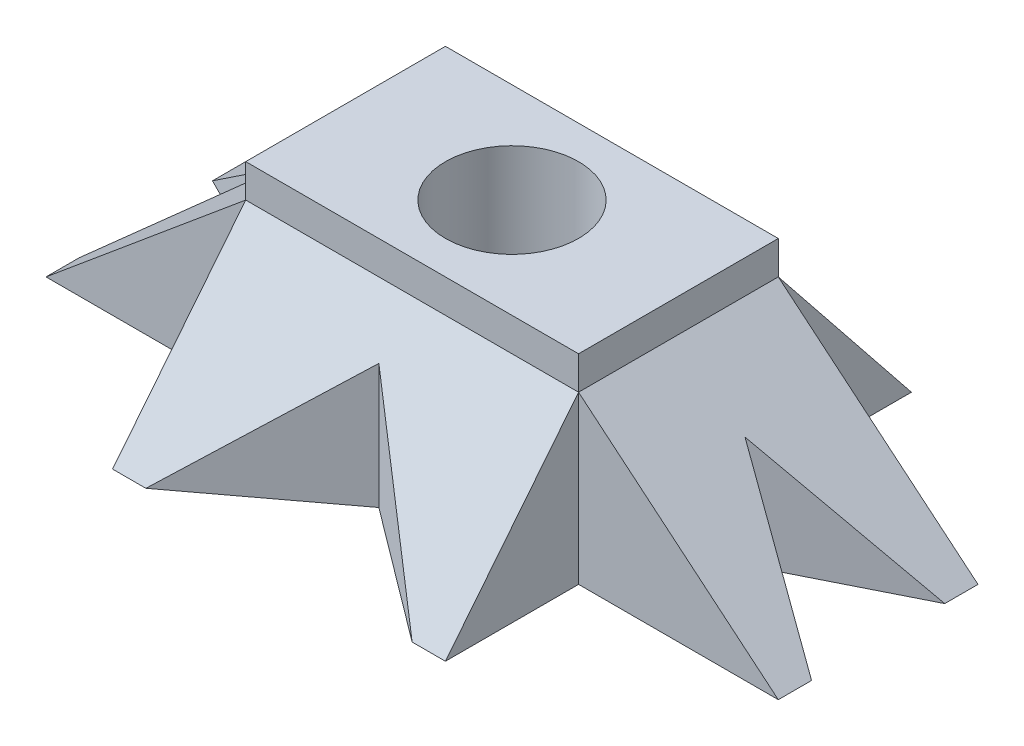
ISO-10303-21;
HEADER;
FILE_DESCRIPTION(('STEP AP214'),'2;1');
FILE_NAME('part.step','',(''),(''),'','','');
FILE_SCHEMA(('AUTOMOTIVE_DESIGN { 1 0 10303 214 1 1 1 1 }'));
ENDSEC;
DATA;
#1=APPLICATION_CONTEXT('core data for automotive mechanical design processes');
#2=APPLICATION_PROTOCOL_DEFINITION('international standard','automotive_design',2000,#1);
#3=PRODUCT_CONTEXT('',#1,'mechanical');
#4=PRODUCT('Part','Part','',(#3));
#5=PRODUCT_RELATED_PRODUCT_CATEGORY('part','',(#4));
#6=PRODUCT_DEFINITION_FORMATION('','',#4);
#7=PRODUCT_DEFINITION_CONTEXT('part definition',#1,'design');
#8=PRODUCT_DEFINITION('design','',#6,#7);
#9=PRODUCT_DEFINITION_SHAPE('','',#8);
#10=(LENGTH_UNIT() NAMED_UNIT(*) SI_UNIT(.MILLI.,.METRE.));
#11=(NAMED_UNIT(*) PLANE_ANGLE_UNIT() SI_UNIT($,.RADIAN.));
#12=(NAMED_UNIT(*) SI_UNIT($,.STERADIAN.) SOLID_ANGLE_UNIT());
#13=UNCERTAINTY_MEASURE_WITH_UNIT(LENGTH_MEASURE(1.E-05),#10,'distance_accuracy_value','');
#14=(GEOMETRIC_REPRESENTATION_CONTEXT(3) GLOBAL_UNCERTAINTY_ASSIGNED_CONTEXT((#13)) GLOBAL_UNIT_ASSIGNED_CONTEXT((#10,
#11,#12)) REPRESENTATION_CONTEXT('',''));
#15=CARTESIAN_POINT('',(0.,0.,0.));
#16=DIRECTION('',(0.,0.,1.));
#17=DIRECTION('',(1.,0.,0.));
#18=AXIS2_PLACEMENT_3D('',#15,#16,#17);
#19=CARTESIAN_POINT('',(0.,0.,0.));
#20=DIRECTION('',(0.,1.,0.));
#21=DIRECTION('',(0.,0.,1.));
#22=AXIS2_PLACEMENT_3D('',#19,#20,#21);
#23=PLANE('',#22);
#24=CARTESIAN_POINT('',(0.,0.,0.));
#25=DIRECTION('',(0.,1.,0.));
#26=DIRECTION('',(0.,0.,1.));
#27=AXIS2_PLACEMENT_3D('',#24,#25,#26);
#28=CIRCLE('',#27,20.);
#29=CARTESIAN_POINT('',(0.,0.,20.));
#30=VERTEX_POINT('',#29);
#31=EDGE_CURVE('E239',#30,#30,#28,.T.);
#32=ORIENTED_EDGE('',*,*,#31,.T.);
#33=EDGE_LOOP('',(#32));
#34=FACE_BOUND('',#33,.T.);
#35=DIRECTION('',(-0.8,0.,-0.6));
#36=VECTOR('',#35,1.);
#37=CARTESIAN_POINT('',(0.,0.,40.));
#38=LINE('',#37,#36);
#39=CARTESIAN_POINT('',(40.,0.,70.));
#40=VERTEX_POINT('',#39);
#41=CARTESIAN_POINT('',(0.,0.,40.));
#42=VERTEX_POINT('',#41);
#43=EDGE_CURVE('E164',#40,#42,#38,.T.);
#44=ORIENTED_EDGE('',*,*,#43,.T.);
#45=DIRECTION('',(-0.8,0.,0.6));
#46=VECTOR('',#45,1.);
#47=CARTESIAN_POINT('',(-40.,0.,70.));
#48=LINE('',#47,#46);
#49=CARTESIAN_POINT('',(-40.,0.,70.));
#50=VERTEX_POINT('',#49);
#51=EDGE_CURVE('E175',#42,#50,#48,.T.);
#52=ORIENTED_EDGE('',*,*,#51,.T.);
#53=DIRECTION('',(-1.,0.,0.));
#54=VECTOR('',#53,1.);
#55=CARTESIAN_POINT('',(50.,0.,70.));
#56=LINE('',#55,#54);
#57=CARTESIAN_POINT('',(-50.,0.,70.));
#58=VERTEX_POINT('',#57);
#59=EDGE_CURVE('E194',#50,#58,#56,.T.);
#60=ORIENTED_EDGE('',*,*,#59,.T.);
#61=DIRECTION('',(0.,0.,-1.));
#62=VECTOR('',#61,1.);
#63=CARTESIAN_POINT('',(-50.,0.,70.));
#64=LINE('',#63,#62);
#65=CARTESIAN_POINT('',(-50.,0.,30.));
#66=VERTEX_POINT('',#65);
#67=EDGE_CURVE('E335',#58,#66,#64,.T.);
#68=ORIENTED_EDGE('',*,*,#67,.T.);
#69=DIRECTION('',(1.,0.,0.));
#70=VECTOR('',#69,1.);
#71=CARTESIAN_POINT('',(-50.,0.,30.));
#72=LINE('',#71,#70);
#73=CARTESIAN_POINT('',(-110.,0.,30.));
#74=VERTEX_POINT('',#73);
#75=EDGE_CURVE('E253',#74,#66,#72,.T.);
#76=ORIENTED_EDGE('',*,*,#75,.F.);
#77=DIRECTION('',(0.,0.,-1.));
#78=VECTOR('',#77,1.);
#79=CARTESIAN_POINT('',(-110.,0.,30.));
#80=LINE('',#79,#78);
#81=CARTESIAN_POINT('',(-110.,0.,20.));
#82=VERTEX_POINT('',#81);
#83=EDGE_CURVE('E218',#74,#82,#80,.T.);
#84=ORIENTED_EDGE('',*,*,#83,.T.);
#85=DIRECTION('',(0.894427190999916,0.,-0.447213595499958));
#86=VECTOR('',#85,1.);
#87=CARTESIAN_POINT('',(-110.,0.,20.));
#88=LINE('',#87,#86);
#89=CARTESIAN_POINT('',(-70.,0.,0.));
#90=VERTEX_POINT('',#89);
#91=EDGE_CURVE('E62',#82,#90,#88,.T.);
#92=ORIENTED_EDGE('',*,*,#91,.T.);
#93=DIRECTION('',(-0.894427190999916,0.,-0.447213595499958));
#94=VECTOR('',#93,1.);
#95=CARTESIAN_POINT('',(-70.,0.,0.));
#96=LINE('',#95,#94);
#97=CARTESIAN_POINT('',(-110.,0.,-20.));
#98=VERTEX_POINT('',#97);
#99=EDGE_CURVE('E383',#90,#98,#96,.T.);
#100=ORIENTED_EDGE('',*,*,#99,.T.);
#101=CARTESIAN_POINT('',(-110.,0.,-30.));
#102=VERTEX_POINT('',#101);
#103=EDGE_CURVE('E217',#98,#102,#80,.T.);
#104=ORIENTED_EDGE('',*,*,#103,.T.);
#105=DIRECTION('',(-1.,0.,0.));
#106=VECTOR('',#105,1.);
#107=CARTESIAN_POINT('',(-50.,0.,-30.));
#108=LINE('',#107,#106);
#109=CARTESIAN_POINT('',(-50.,0.,-30.));
#110=VERTEX_POINT('',#109);
#111=EDGE_CURVE('E244',#110,#102,#108,.T.);
#112=ORIENTED_EDGE('',*,*,#111,.F.);
#113=DIRECTION('',(0.,0.,-1.));
#114=VECTOR('',#113,1.);
#115=CARTESIAN_POINT('',(-50.,0.,-70.));
#116=LINE('',#115,#114);
#117=CARTESIAN_POINT('',(-50.,0.,-70.));
#118=VERTEX_POINT('',#117);
#119=EDGE_CURVE('E366',#110,#118,#116,.T.);
#120=ORIENTED_EDGE('',*,*,#119,.T.);
#121=DIRECTION('',(-1.,0.,0.));
#122=VECTOR('',#121,1.);
#123=CARTESIAN_POINT('',(50.,0.,-70.));
#124=LINE('',#123,#122);
#125=CARTESIAN_POINT('',(-40.,0.,-70.));
#126=VERTEX_POINT('',#125);
#127=EDGE_CURVE('E351',#126,#118,#124,.T.);
#128=ORIENTED_EDGE('',*,*,#127,.F.);
#129=DIRECTION('',(0.8,0.,0.6));
#130=VECTOR('',#129,1.);
#131=CARTESIAN_POINT('',(-40.,0.,-70.));
#132=LINE('',#131,#130);
#133=CARTESIAN_POINT('',(0.,0.,-40.));
#134=VERTEX_POINT('',#133);
#135=EDGE_CURVE('E388',#126,#134,#132,.T.);
#136=ORIENTED_EDGE('',*,*,#135,.T.);
#137=DIRECTION('',(0.8,0.,-0.6));
#138=VECTOR('',#137,1.);
#139=CARTESIAN_POINT('',(0.,0.,-40.));
#140=LINE('',#139,#138);
#141=CARTESIAN_POINT('',(40.,0.,-70.));
#142=VERTEX_POINT('',#141);
#143=EDGE_CURVE('E394',#134,#142,#140,.T.);
#144=ORIENTED_EDGE('',*,*,#143,.T.);
#145=CARTESIAN_POINT('',(50.,0.,-70.));
#146=VERTEX_POINT('',#145);
#147=EDGE_CURVE('E339',#146,#142,#124,.T.);
#148=ORIENTED_EDGE('',*,*,#147,.F.);
#149=DIRECTION('',(0.,0.,-1.));
#150=VECTOR('',#149,1.);
#151=CARTESIAN_POINT('',(50.,0.,-70.));
#152=LINE('',#151,#150);
#153=CARTESIAN_POINT('',(50.,0.,-30.));
#154=VERTEX_POINT('',#153);
#155=EDGE_CURVE('E361',#154,#146,#152,.T.);
#156=ORIENTED_EDGE('',*,*,#155,.F.);
#157=CARTESIAN_POINT('',(110.,0.,-30.));
#158=VERTEX_POINT('',#157);
#159=EDGE_CURVE('E263',#158,#154,#108,.T.);
#160=ORIENTED_EDGE('',*,*,#159,.F.);
#161=DIRECTION('',(0.,0.,-1.));
#162=VECTOR('',#161,1.);
#163=CARTESIAN_POINT('',(110.,0.,30.));
#164=LINE('',#163,#162);
#165=CARTESIAN_POINT('',(110.,0.,-20.));
#166=VERTEX_POINT('',#165);
#167=EDGE_CURVE('E234',#166,#158,#164,.T.);
#168=ORIENTED_EDGE('',*,*,#167,.F.);
#169=DIRECTION('',(-0.894427190999916,0.,0.447213595499958));
#170=VECTOR('',#169,1.);
#171=CARTESIAN_POINT('',(70.,0.,0.));
#172=LINE('',#171,#170);
#173=CARTESIAN_POINT('',(70.,0.,0.));
#174=VERTEX_POINT('',#173);
#175=EDGE_CURVE('E307',#166,#174,#172,.T.);
#176=ORIENTED_EDGE('',*,*,#175,.T.);
#177=DIRECTION('',(0.894427190999916,0.,0.447213595499958));
#178=VECTOR('',#177,1.);
#179=CARTESIAN_POINT('',(110.,0.,20.));
#180=LINE('',#179,#178);
#181=CARTESIAN_POINT('',(110.,0.,20.));
#182=VERTEX_POINT('',#181);
#183=EDGE_CURVE('E301',#174,#182,#180,.T.);
#184=ORIENTED_EDGE('',*,*,#183,.T.);
#185=CARTESIAN_POINT('',(110.,0.,30.));
#186=VERTEX_POINT('',#185);
#187=EDGE_CURVE('E235',#186,#182,#164,.T.);
#188=ORIENTED_EDGE('',*,*,#187,.F.);
#189=CARTESIAN_POINT('',(50.,0.,30.));
#190=VERTEX_POINT('',#189);
#191=EDGE_CURVE('E267',#190,#186,#72,.T.);
#192=ORIENTED_EDGE('',*,*,#191,.F.);
#193=DIRECTION('',(0.,0.,-1.));
#194=VECTOR('',#193,1.);
#195=CARTESIAN_POINT('',(50.,0.,70.));
#196=LINE('',#195,#194);
#197=CARTESIAN_POINT('',(50.,0.,70.));
#198=VERTEX_POINT('',#197);
#199=EDGE_CURVE('E191',#198,#190,#196,.T.);
#200=ORIENTED_EDGE('',*,*,#199,.F.);
#201=EDGE_CURVE('E182',#198,#40,#56,.T.);
#202=ORIENTED_EDGE('',*,*,#201,.T.);
#203=EDGE_LOOP('',(#44,#52,#60,#68,#76,#84,#92,#100,#104,#112,#120,#128,#136,#144,#148,#156,
#160,#168,#176,#184,#188,#192,#200,#202));
#204=FACE_BOUND('',#203,.T.);
#205=ADVANCED_FACE('F39',(#34,#204),#23,.F.);
#206=CARTESIAN_POINT('',(50.,50.,30.));
#207=DIRECTION('',(-0.64018439966448,-0.768221279597376,0.));
#208=DIRECTION('',(0.768221279597376,-0.64018439966448,0.));
#209=AXIS2_PLACEMENT_3D('',#206,#207,#208);
#210=PLANE('',#209);
#211=DIRECTION('',(-0.717137165600636,0.597614304667197,0.358568582800318));
#212=VECTOR('',#211,1.);
#213=CARTESIAN_POINT('',(44.8571428571429,54.2857142857143,12.5714285714286));
#214=LINE('',#213,#212);
#215=CARTESIAN_POINT('',(70.,33.3333333333333,0.));
#216=VERTEX_POINT('',#215);
#217=EDGE_CURVE('E11',#166,#216,#214,.T.);
#218=ORIENTED_EDGE('',*,*,#217,.F.);
#219=ORIENTED_EDGE('',*,*,#167,.T.);
#220=DIRECTION('',(-0.768221279597376,0.64018439966448,0.));
#221=VECTOR('',#220,1.);
#222=CARTESIAN_POINT('',(50.,50.,-30.));
#223=LINE('',#222,#221);
#224=CARTESIAN_POINT('',(50.,50.,-30.));
#225=VERTEX_POINT('',#224);
#226=EDGE_CURVE('E222',#158,#225,#223,.T.);
#227=ORIENTED_EDGE('',*,*,#226,.T.);
#228=DIRECTION('',(0.,0.,-1.));
#229=VECTOR('',#228,1.);
#230=CARTESIAN_POINT('',(50.,50.,30.));
#231=LINE('',#230,#229);
#232=CARTESIAN_POINT('',(50.,50.,30.));
#233=VERTEX_POINT('',#232);
#234=EDGE_CURVE('E227',#233,#225,#231,.T.);
#235=ORIENTED_EDGE('',*,*,#234,.F.);
#236=DIRECTION('',(-0.768221279597376,0.64018439966448,0.));
#237=VECTOR('',#236,1.);
#238=CARTESIAN_POINT('',(50.,50.,30.));
#239=LINE('',#238,#237);
#240=EDGE_CURVE('E223',#186,#233,#239,.T.);
#241=ORIENTED_EDGE('',*,*,#240,.F.);
#242=ORIENTED_EDGE('',*,*,#187,.T.);
#243=DIRECTION('',(0.717137165600636,-0.597614304667197,0.358568582800318));
#244=VECTOR('',#243,1.);
#245=CARTESIAN_POINT('',(60.2857142857143,41.4285714285714,-4.85714285714287));
#246=LINE('',#245,#244);
#247=EDGE_CURVE('E48',#216,#182,#246,.T.);
#248=ORIENTED_EDGE('',*,*,#247,.F.);
#249=EDGE_LOOP('',(#218,#219,#227,#235,#241,#242,#248));
#250=FACE_BOUND('',#249,.T.);
#251=ADVANCED_FACE('F311',(#250),#210,.F.);
#252=CARTESIAN_POINT('',(-50.,50.,30.));
#253=DIRECTION('',(0.64018439966448,-0.768221279597376,0.));
#254=DIRECTION('',(0.768221279597376,0.64018439966448,0.));
#255=AXIS2_PLACEMENT_3D('',#252,#253,#254);
#256=PLANE('',#255);
#257=DIRECTION('',(-0.717137165600636,-0.597614304667197,-0.358568582800318));
#258=VECTOR('',#257,1.);
#259=CARTESIAN_POINT('',(-44.8571428571429,54.2857142857143,12.5714285714286));
#260=LINE('',#259,#258);
#261=CARTESIAN_POINT('',(-70.,33.3333333333333,0.));
#262=VERTEX_POINT('',#261);
#263=EDGE_CURVE('E295',#262,#98,#260,.T.);
#264=ORIENTED_EDGE('',*,*,#263,.F.);
#265=DIRECTION('',(0.717137165600636,0.597614304667197,-0.358568582800318));
#266=VECTOR('',#265,1.);
#267=CARTESIAN_POINT('',(-60.2857142857143,41.4285714285714,-4.85714285714284));
#268=LINE('',#267,#266);
#269=EDGE_CURVE('E187',#82,#262,#268,.T.);
#270=ORIENTED_EDGE('',*,*,#269,.F.);
#271=ORIENTED_EDGE('',*,*,#83,.F.);
#272=DIRECTION('',(-0.768221279597376,-0.64018439966448,0.));
#273=VECTOR('',#272,1.);
#274=CARTESIAN_POINT('',(-50.,50.,30.));
#275=LINE('',#274,#273);
#276=CARTESIAN_POINT('',(-50.,50.,30.));
#277=VERTEX_POINT('',#276);
#278=EDGE_CURVE('E206',#277,#74,#275,.T.);
#279=ORIENTED_EDGE('',*,*,#278,.F.);
#280=DIRECTION('',(0.,0.,-1.));
#281=VECTOR('',#280,1.);
#282=CARTESIAN_POINT('',(-50.,50.,30.));
#283=LINE('',#282,#281);
#284=CARTESIAN_POINT('',(-50.,50.,-30.));
#285=VERTEX_POINT('',#284);
#286=EDGE_CURVE('E210',#277,#285,#283,.T.);
#287=ORIENTED_EDGE('',*,*,#286,.T.);
#288=DIRECTION('',(-0.768221279597376,-0.64018439966448,0.));
#289=VECTOR('',#288,1.);
#290=CARTESIAN_POINT('',(-50.,50.,-30.));
#291=LINE('',#290,#289);
#292=EDGE_CURVE('E199',#285,#102,#291,.T.);
#293=ORIENTED_EDGE('',*,*,#292,.T.);
#294=ORIENTED_EDGE('',*,*,#103,.F.);
#295=EDGE_LOOP('',(#264,#270,#271,#279,#287,#293,#294));
#296=FACE_BOUND('',#295,.T.);
#297=ADVANCED_FACE('F424',(#296),#256,.F.);
#298=CARTESIAN_POINT('',(50.,50.,30.));
#299=DIRECTION('',(0.,-0.624695047554424,-0.78086880944303));
#300=DIRECTION('',(0.,0.78086880944303,-0.624695047554424));
#301=AXIS2_PLACEMENT_3D('',#298,#299,#300);
#302=PLANE('',#301);
#303=DIRECTION('',(-0.64,0.6,-0.48));
#304=VECTOR('',#303,1.);
#305=CARTESIAN_POINT('',(12.608,25.68,49.456));
#306=LINE('',#305,#304);
#307=CARTESIAN_POINT('',(0.,37.5,40.));
#308=VERTEX_POINT('',#307);
#309=EDGE_CURVE('E167',#40,#308,#306,.T.);
#310=ORIENTED_EDGE('',*,*,#309,.F.);
#311=ORIENTED_EDGE('',*,*,#201,.F.);
#312=DIRECTION('',(0.,-0.78086880944303,0.624695047554424));
#313=VECTOR('',#312,1.);
#314=CARTESIAN_POINT('',(50.,50.,30.));
#315=LINE('',#314,#313);
#316=EDGE_CURVE('E201',#233,#198,#315,.T.);
#317=ORIENTED_EDGE('',*,*,#316,.F.);
#318=DIRECTION('',(-1.,0.,0.));
#319=VECTOR('',#318,1.);
#320=CARTESIAN_POINT('',(50.,50.,30.));
#321=LINE('',#320,#319);
#322=EDGE_CURVE('E193',#233,#277,#321,.T.);
#323=ORIENTED_EDGE('',*,*,#322,.T.);
#324=DIRECTION('',(0.,-0.78086880944303,0.624695047554424));
#325=VECTOR('',#324,1.);
#326=CARTESIAN_POINT('',(-50.,50.,30.));
#327=LINE('',#326,#325);
#328=EDGE_CURVE('E203',#277,#58,#327,.T.);
#329=ORIENTED_EDGE('',*,*,#328,.T.);
#330=ORIENTED_EDGE('',*,*,#59,.F.);
#331=DIRECTION('',(-0.64,-0.6,0.48));
#332=VECTOR('',#331,1.);
#333=CARTESIAN_POINT('',(28.352,64.08,18.736));
#334=LINE('',#333,#332);
#335=EDGE_CURVE('E185',#308,#50,#334,.T.);
#336=ORIENTED_EDGE('',*,*,#335,.F.);
#337=EDGE_LOOP('',(#310,#311,#317,#323,#329,#330,#336));
#338=FACE_BOUND('',#337,.T.);
#339=ADVANCED_FACE('F180',(#338),#302,.F.);
#340=CARTESIAN_POINT('',(50.,50.,-30.));
#341=DIRECTION('',(0.,-0.624695047554424,0.78086880944303));
#342=DIRECTION('',(0.,-0.78086880944303,-0.624695047554424));
#343=AXIS2_PLACEMENT_3D('',#340,#341,#342);
#344=PLANE('',#343);
#345=DIRECTION('',(0.64,0.6,0.48));
#346=VECTOR('',#345,1.);
#347=CARTESIAN_POINT('',(28.352,64.08,-18.736));
#348=LINE('',#347,#346);
#349=CARTESIAN_POINT('',(0.,37.5,-40.));
#350=VERTEX_POINT('',#349);
#351=EDGE_CURVE('E287',#126,#350,#348,.T.);
#352=ORIENTED_EDGE('',*,*,#351,.F.);
#353=ORIENTED_EDGE('',*,*,#127,.T.);
#354=DIRECTION('',(0.,0.78086880944303,0.624695047554424));
#355=VECTOR('',#354,1.);
#356=CARTESIAN_POINT('',(-50.,50.,-30.));
#357=LINE('',#356,#355);
#358=EDGE_CURVE('E362',#118,#285,#357,.T.);
#359=ORIENTED_EDGE('',*,*,#358,.T.);
#360=DIRECTION('',(-1.,0.,0.));
#361=VECTOR('',#360,1.);
#362=CARTESIAN_POINT('',(50.,50.,-30.));
#363=LINE('',#362,#361);
#364=EDGE_CURVE('E352',#225,#285,#363,.T.);
#365=ORIENTED_EDGE('',*,*,#364,.F.);
#366=DIRECTION('',(0.,0.78086880944303,0.624695047554424));
#367=VECTOR('',#366,1.);
#368=CARTESIAN_POINT('',(50.,50.,-30.));
#369=LINE('',#368,#367);
#370=EDGE_CURVE('E372',#146,#225,#369,.T.);
#371=ORIENTED_EDGE('',*,*,#370,.F.);
#372=ORIENTED_EDGE('',*,*,#147,.T.);
#373=DIRECTION('',(0.64,-0.6,-0.48));
#374=VECTOR('',#373,1.);
#375=CARTESIAN_POINT('',(12.608,25.68,-49.456));
#376=LINE('',#375,#374);
#377=EDGE_CURVE('E284',#350,#142,#376,.T.);
#378=ORIENTED_EDGE('',*,*,#377,.F.);
#379=EDGE_LOOP('',(#352,#353,#359,#365,#371,#372,#378));
#380=FACE_BOUND('',#379,.T.);
#381=ADVANCED_FACE('F447',(#380),#344,.F.);
#382=CARTESIAN_POINT('',(-50.,60.,-30.));
#383=DIRECTION('',(0.,0.,1.));
#384=DIRECTION('',(1.,0.,0.));
#385=AXIS2_PLACEMENT_3D('',#382,#383,#384);
#386=PLANE('',#385);
#387=DIRECTION('',(0.,-1.,0.));
#388=VECTOR('',#387,1.);
#389=CARTESIAN_POINT('',(50.,0.,-30.));
#390=LINE('',#389,#388);
#391=EDGE_CURVE('E356',#225,#154,#390,.T.);
#392=ORIENTED_EDGE('',*,*,#391,.F.);
#393=ORIENTED_EDGE('',*,*,#226,.F.);
#394=ORIENTED_EDGE('',*,*,#159,.T.);
#395=EDGE_LOOP('',(#392,#393,#394));
#396=FACE_BOUND('',#395,.T.);
#397=ADVANCED_FACE('F440',(#396),#386,.F.);
#398=ORIENTED_EDGE('',*,*,#292,.F.);
#399=DIRECTION('',(0.,-1.,0.));
#400=VECTOR('',#399,1.);
#401=CARTESIAN_POINT('',(-50.,0.,-30.));
#402=LINE('',#401,#400);
#403=EDGE_CURVE('E357',#285,#110,#402,.T.);
#404=ORIENTED_EDGE('',*,*,#403,.T.);
#405=ORIENTED_EDGE('',*,*,#111,.T.);
#406=EDGE_LOOP('',(#398,#404,#405));
#407=FACE_BOUND('',#406,.T.);
#408=ADVANCED_FACE('F441',(#407),#386,.F.);
#409=CARTESIAN_POINT('',(-50.,60.,30.));
#410=DIRECTION('',(0.,0.,-1.));
#411=DIRECTION('',(-1.,0.,0.));
#412=AXIS2_PLACEMENT_3D('',#409,#410,#411);
#413=PLANE('',#412);
#414=ORIENTED_EDGE('',*,*,#322,.F.);
#415=DIRECTION('',(0.,-1.,0.));
#416=VECTOR('',#415,1.);
#417=CARTESIAN_POINT('',(50.,60.,30.));
#418=LINE('',#417,#416);
#419=CARTESIAN_POINT('',(50.,60.,30.));
#420=VERTEX_POINT('',#419);
#421=EDGE_CURVE('E262',#420,#233,#418,.T.);
#422=ORIENTED_EDGE('',*,*,#421,.F.);
#423=DIRECTION('',(1.,0.,0.));
#424=VECTOR('',#423,1.);
#425=CARTESIAN_POINT('',(-50.,60.,30.));
#426=LINE('',#425,#424);
#427=CARTESIAN_POINT('',(-50.,60.,30.));
#428=VERTEX_POINT('',#427);
#429=EDGE_CURVE('E259',#428,#420,#426,.T.);
#430=ORIENTED_EDGE('',*,*,#429,.F.);
#431=DIRECTION('',(0.,-1.,0.));
#432=VECTOR('',#431,1.);
#433=CARTESIAN_POINT('',(-50.,60.,30.));
#434=LINE('',#433,#432);
#435=EDGE_CURVE('E272',#428,#277,#434,.T.);
#436=ORIENTED_EDGE('',*,*,#435,.T.);
#437=EDGE_LOOP('',(#414,#422,#430,#436));
#438=FACE_BOUND('',#437,.T.);
#439=ADVANCED_FACE('F320',(#438),#413,.F.);
#440=DIRECTION('',(0.,1.,0.));
#441=VECTOR('',#440,1.);
#442=CARTESIAN_POINT('',(50.,0.,30.));
#443=LINE('',#442,#441);
#444=EDGE_CURVE('E317',#190,#233,#443,.T.);
#445=ORIENTED_EDGE('',*,*,#444,.F.);
#446=ORIENTED_EDGE('',*,*,#191,.T.);
#447=ORIENTED_EDGE('',*,*,#240,.T.);
#448=EDGE_LOOP('',(#445,#446,#447));
#449=FACE_BOUND('',#448,.T.);
#450=ADVANCED_FACE('F315',(#449),#413,.F.);
#451=CARTESIAN_POINT('',(-50.,60.,-30.));
#452=DIRECTION('',(1.,0.,0.));
#453=DIRECTION('',(0.,0.,-1.));
#454=AXIS2_PLACEMENT_3D('',#451,#452,#453);
#455=PLANE('',#454);
#456=ORIENTED_EDGE('',*,*,#286,.F.);
#457=ORIENTED_EDGE('',*,*,#435,.F.);
#458=DIRECTION('',(0.,0.,1.));
#459=VECTOR('',#458,1.);
#460=CARTESIAN_POINT('',(-50.,60.,-30.));
#461=LINE('',#460,#459);
#462=CARTESIAN_POINT('',(-50.,60.,-30.));
#463=VERTEX_POINT('',#462);
#464=EDGE_CURVE('E256',#463,#428,#461,.T.);
#465=ORIENTED_EDGE('',*,*,#464,.F.);
#466=DIRECTION('',(0.,-1.,0.));
#467=VECTOR('',#466,1.);
#468=CARTESIAN_POINT('',(-50.,60.,-30.));
#469=LINE('',#468,#467);
#470=EDGE_CURVE('E276',#463,#285,#469,.T.);
#471=ORIENTED_EDGE('',*,*,#470,.T.);
#472=EDGE_LOOP('',(#456,#457,#465,#471));
#473=FACE_BOUND('',#472,.T.);
#474=ADVANCED_FACE('F435',(#473),#455,.F.);
#475=CARTESIAN_POINT('',(0.,60.,0.));
#476=DIRECTION('',(0.,1.,0.));
#477=DIRECTION('',(0.,0.,1.));
#478=AXIS2_PLACEMENT_3D('',#475,#476,#477);
#479=PLANE('',#478);
#480=DIRECTION('',(0.,0.,-1.));
#481=VECTOR('',#480,1.);
#482=CARTESIAN_POINT('',(50.,60.,-30.));
#483=LINE('',#482,#481);
#484=CARTESIAN_POINT('',(50.,60.,-30.));
#485=VERTEX_POINT('',#484);
#486=EDGE_CURVE('E248',#420,#485,#483,.T.);
#487=ORIENTED_EDGE('',*,*,#486,.T.);
#488=DIRECTION('',(-1.,0.,0.));
#489=VECTOR('',#488,1.);
#490=CARTESIAN_POINT('',(-50.,60.,-30.));
#491=LINE('',#490,#489);
#492=EDGE_CURVE('E252',#485,#463,#491,.T.);
#493=ORIENTED_EDGE('',*,*,#492,.T.);
#494=ORIENTED_EDGE('',*,*,#464,.T.);
#495=ORIENTED_EDGE('',*,*,#429,.T.);
#496=EDGE_LOOP('',(#487,#493,#494,#495));
#497=FACE_BOUND('',#496,.T.);
#498=CARTESIAN_POINT('',(0.,60.,0.));
#499=DIRECTION('',(0.,1.,0.));
#500=DIRECTION('',(0.,0.,1.));
#501=AXIS2_PLACEMENT_3D('',#498,#499,#500);
#502=CIRCLE('',#501,20.);
#503=CARTESIAN_POINT('',(0.,60.,20.));
#504=VERTEX_POINT('',#503);
#505=EDGE_CURVE('E240',#504,#504,#502,.T.);
#506=ORIENTED_EDGE('',*,*,#505,.F.);
#507=EDGE_LOOP('',(#506));
#508=FACE_BOUND('',#507,.T.);
#509=ADVANCED_FACE('F428',(#497,#508),#479,.T.);
#510=CARTESIAN_POINT('',(50.,60.,-30.));
#511=DIRECTION('',(-1.,0.,0.));
#512=DIRECTION('',(0.,0.,1.));
#513=AXIS2_PLACEMENT_3D('',#510,#511,#512);
#514=PLANE('',#513);
#515=ORIENTED_EDGE('',*,*,#421,.T.);
#516=ORIENTED_EDGE('',*,*,#234,.T.);
#517=DIRECTION('',(0.,-1.,0.));
#518=VECTOR('',#517,1.);
#519=CARTESIAN_POINT('',(50.,60.,-30.));
#520=LINE('',#519,#518);
#521=EDGE_CURVE('E280',#485,#225,#520,.T.);
#522=ORIENTED_EDGE('',*,*,#521,.F.);
#523=ORIENTED_EDGE('',*,*,#486,.F.);
#524=EDGE_LOOP('',(#515,#516,#522,#523));
#525=FACE_BOUND('',#524,.T.);
#526=ADVANCED_FACE('F41',(#525),#514,.F.);
#527=ORIENTED_EDGE('',*,*,#521,.T.);
#528=ORIENTED_EDGE('',*,*,#364,.T.);
#529=ORIENTED_EDGE('',*,*,#470,.F.);
#530=ORIENTED_EDGE('',*,*,#492,.F.);
#531=EDGE_LOOP('',(#527,#528,#529,#530));
#532=FACE_BOUND('',#531,.T.);
#533=ADVANCED_FACE('F434',(#532),#386,.F.);
#534=ORIENTED_EDGE('',*,*,#75,.T.);
#535=DIRECTION('',(0.,1.,0.));
#536=VECTOR('',#535,1.);
#537=CARTESIAN_POINT('',(-50.,0.,30.));
#538=LINE('',#537,#536);
#539=EDGE_CURVE('E338',#66,#277,#538,.T.);
#540=ORIENTED_EDGE('',*,*,#539,.T.);
#541=ORIENTED_EDGE('',*,*,#278,.T.);
#542=EDGE_LOOP('',(#534,#540,#541));
#543=FACE_BOUND('',#542,.T.);
#544=ADVANCED_FACE('F430',(#543),#413,.F.);
#545=CARTESIAN_POINT('',(0.,60.,0.));
#546=DIRECTION('',(0.,-1.,0.));
#547=DIRECTION('',(0.,0.,-1.));
#548=AXIS2_PLACEMENT_3D('',#545,#546,#547);
#549=CYLINDRICAL_SURFACE('',#548,20.);
#550=ORIENTED_EDGE('',*,*,#505,.T.);
#551=EDGE_LOOP('',(#550));
#552=FACE_BOUND('',#551,.T.);
#553=ORIENTED_EDGE('',*,*,#31,.F.);
#554=EDGE_LOOP('',(#553));
#555=FACE_BOUND('',#554,.T.);
#556=ADVANCED_FACE('F433',(#552,#555),#549,.F.);
#557=CARTESIAN_POINT('',(50.,0.,0.));
#558=DIRECTION('',(1.,0.,0.));
#559=DIRECTION('',(0.,0.,-1.));
#560=AXIS2_PLACEMENT_3D('',#557,#558,#559);
#561=PLANE('',#560);
#562=ORIENTED_EDGE('',*,*,#199,.T.);
#563=ORIENTED_EDGE('',*,*,#444,.T.);
#564=ORIENTED_EDGE('',*,*,#316,.T.);
#565=EDGE_LOOP('',(#562,#563,#564));
#566=FACE_BOUND('',#565,.T.);
#567=ADVANCED_FACE('F328',(#566),#561,.T.);
#568=CARTESIAN_POINT('',(-50.,0.,0.));
#569=DIRECTION('',(1.,0.,0.));
#570=DIRECTION('',(0.,0.,-1.));
#571=AXIS2_PLACEMENT_3D('',#568,#569,#570);
#572=PLANE('',#571);
#573=ORIENTED_EDGE('',*,*,#67,.F.);
#574=ORIENTED_EDGE('',*,*,#328,.F.);
#575=ORIENTED_EDGE('',*,*,#539,.F.);
#576=EDGE_LOOP('',(#573,#574,#575));
#577=FACE_BOUND('',#576,.T.);
#578=ADVANCED_FACE('F484',(#577),#572,.F.);
#579=CARTESIAN_POINT('',(50.,0.,0.));
#580=DIRECTION('',(-1.,0.,0.));
#581=DIRECTION('',(0.,0.,1.));
#582=AXIS2_PLACEMENT_3D('',#579,#580,#581);
#583=PLANE('',#582);
#584=ORIENTED_EDGE('',*,*,#155,.T.);
#585=ORIENTED_EDGE('',*,*,#370,.T.);
#586=ORIENTED_EDGE('',*,*,#391,.T.);
#587=EDGE_LOOP('',(#584,#585,#586));
#588=FACE_BOUND('',#587,.T.);
#589=ADVANCED_FACE('F492',(#588),#583,.F.);
#590=CARTESIAN_POINT('',(-50.,0.,0.));
#591=DIRECTION('',(-1.,0.,0.));
#592=DIRECTION('',(0.,0.,1.));
#593=AXIS2_PLACEMENT_3D('',#590,#591,#592);
#594=PLANE('',#593);
#595=ORIENTED_EDGE('',*,*,#119,.F.);
#596=ORIENTED_EDGE('',*,*,#403,.F.);
#597=ORIENTED_EDGE('',*,*,#358,.F.);
#598=EDGE_LOOP('',(#595,#596,#597));
#599=FACE_BOUND('',#598,.T.);
#600=ADVANCED_FACE('F497',(#599),#594,.T.);
#601=CARTESIAN_POINT('',(-40.,60.,-70.));
#602=DIRECTION('',(0.6,0.,-0.8));
#603=DIRECTION('',(-0.8,0.,-0.6));
#604=AXIS2_PLACEMENT_3D('',#601,#602,#603);
#605=PLANE('',#604);
#606=ORIENTED_EDGE('',*,*,#351,.T.);
#607=DIRECTION('',(0.,-1.,0.));
#608=VECTOR('',#607,1.);
#609=CARTESIAN_POINT('',(0.,60.,-40.));
#610=LINE('',#609,#608);
#611=EDGE_CURVE('E176',#350,#134,#610,.T.);
#612=ORIENTED_EDGE('',*,*,#611,.T.);
#613=ORIENTED_EDGE('',*,*,#135,.F.);
#614=EDGE_LOOP('',(#606,#612,#613));
#615=FACE_BOUND('',#614,.T.);
#616=ADVANCED_FACE('F500',(#615),#605,.T.);
#617=CARTESIAN_POINT('',(0.,60.,-40.));
#618=DIRECTION('',(-0.6,0.,-0.8));
#619=DIRECTION('',(-0.8,0.,0.6));
#620=AXIS2_PLACEMENT_3D('',#617,#618,#619);
#621=PLANE('',#620);
#622=ORIENTED_EDGE('',*,*,#377,.T.);
#623=ORIENTED_EDGE('',*,*,#143,.F.);
#624=ORIENTED_EDGE('',*,*,#611,.F.);
#625=EDGE_LOOP('',(#622,#623,#624));
#626=FACE_BOUND('',#625,.T.);
#627=ADVANCED_FACE('F416',(#626),#621,.T.);
#628=CARTESIAN_POINT('',(0.,60.,40.));
#629=DIRECTION('',(-0.6,0.,0.8));
#630=DIRECTION('',(0.8,0.,0.6));
#631=AXIS2_PLACEMENT_3D('',#628,#629,#630);
#632=PLANE('',#631);
#633=ORIENTED_EDGE('',*,*,#309,.T.);
#634=DIRECTION('',(0.,-1.,0.));
#635=VECTOR('',#634,1.);
#636=CARTESIAN_POINT('',(0.,60.,40.));
#637=LINE('',#636,#635);
#638=EDGE_CURVE('E169',#308,#42,#637,.T.);
#639=ORIENTED_EDGE('',*,*,#638,.T.);
#640=ORIENTED_EDGE('',*,*,#43,.F.);
#641=EDGE_LOOP('',(#633,#639,#640));
#642=FACE_BOUND('',#641,.T.);
#643=ADVANCED_FACE('F166',(#642),#632,.T.);
#644=CARTESIAN_POINT('',(-40.,60.,70.));
#645=DIRECTION('',(0.6,0.,0.8));
#646=DIRECTION('',(0.8,0.,-0.6));
#647=AXIS2_PLACEMENT_3D('',#644,#645,#646);
#648=PLANE('',#647);
#649=ORIENTED_EDGE('',*,*,#335,.T.);
#650=ORIENTED_EDGE('',*,*,#51,.F.);
#651=ORIENTED_EDGE('',*,*,#638,.F.);
#652=EDGE_LOOP('',(#649,#650,#651));
#653=FACE_BOUND('',#652,.T.);
#654=ADVANCED_FACE('F405',(#653),#648,.T.);
#655=CARTESIAN_POINT('',(-70.,60.,0.));
#656=DIRECTION('',(-0.447213595499958,0.,0.894427190999916));
#657=DIRECTION('',(0.894427190999916,0.,0.447213595499958));
#658=AXIS2_PLACEMENT_3D('',#655,#656,#657);
#659=PLANE('',#658);
#660=ORIENTED_EDGE('',*,*,#263,.T.);
#661=ORIENTED_EDGE('',*,*,#99,.F.);
#662=DIRECTION('',(0.,-1.,0.));
#663=VECTOR('',#662,1.);
#664=CARTESIAN_POINT('',(-70.,60.,0.));
#665=LINE('',#664,#663);
#666=EDGE_CURVE('E378',#262,#90,#665,.T.);
#667=ORIENTED_EDGE('',*,*,#666,.F.);
#668=EDGE_LOOP('',(#660,#661,#667));
#669=FACE_BOUND('',#668,.T.);
#670=ADVANCED_FACE('F407',(#669),#659,.T.);
#671=CARTESIAN_POINT('',(-110.,60.,20.));
#672=DIRECTION('',(-0.447213595499958,0.,-0.894427190999916));
#673=DIRECTION('',(-0.894427190999916,0.,0.447213595499958));
#674=AXIS2_PLACEMENT_3D('',#671,#672,#673);
#675=PLANE('',#674);
#676=ORIENTED_EDGE('',*,*,#269,.T.);
#677=ORIENTED_EDGE('',*,*,#666,.T.);
#678=ORIENTED_EDGE('',*,*,#91,.F.);
#679=EDGE_LOOP('',(#676,#677,#678));
#680=FACE_BOUND('',#679,.T.);
#681=ADVANCED_FACE('F413',(#680),#675,.T.);
#682=CARTESIAN_POINT('',(70.,60.,0.));
#683=DIRECTION('',(0.447213595499958,0.,0.894427190999916));
#684=DIRECTION('',(0.894427190999916,0.,-0.447213595499958));
#685=AXIS2_PLACEMENT_3D('',#682,#683,#684);
#686=PLANE('',#685);
#687=ORIENTED_EDGE('',*,*,#217,.T.);
#688=DIRECTION('',(0.,-1.,0.));
#689=VECTOR('',#688,1.);
#690=CARTESIAN_POINT('',(70.,60.,0.));
#691=LINE('',#690,#689);
#692=EDGE_CURVE('E55',#216,#174,#691,.T.);
#693=ORIENTED_EDGE('',*,*,#692,.T.);
#694=ORIENTED_EDGE('',*,*,#175,.F.);
#695=EDGE_LOOP('',(#687,#693,#694));
#696=FACE_BOUND('',#695,.T.);
#697=ADVANCED_FACE('F506',(#696),#686,.T.);
#698=CARTESIAN_POINT('',(110.,60.,20.));
#699=DIRECTION('',(0.447213595499958,0.,-0.894427190999916));
#700=DIRECTION('',(-0.894427190999916,0.,-0.447213595499958));
#701=AXIS2_PLACEMENT_3D('',#698,#699,#700);
#702=PLANE('',#701);
#703=ORIENTED_EDGE('',*,*,#247,.T.);
#704=ORIENTED_EDGE('',*,*,#183,.F.);
#705=ORIENTED_EDGE('',*,*,#692,.F.);
#706=EDGE_LOOP('',(#703,#704,#705));
#707=FACE_BOUND('',#706,.T.);
#708=ADVANCED_FACE('F300',(#707),#702,.T.);
#709=CLOSED_SHELL('',(#205,#251,#297,#339,#381,#397,#408,#439,#450,#474,#509,#526,#533,#544,
#556,#567,#578,#589,#600,#616,#627,#643,#654,#670,#681,#697,#708));
#710=MANIFOLD_SOLID_BREP('B2',#709);
#711=ADVANCED_BREP_SHAPE_REPRESENTATION('',(#18,#710),#14);
#712=SHAPE_DEFINITION_REPRESENTATION(#9,#711);
ENDSEC;
END-ISO-10303-21;
